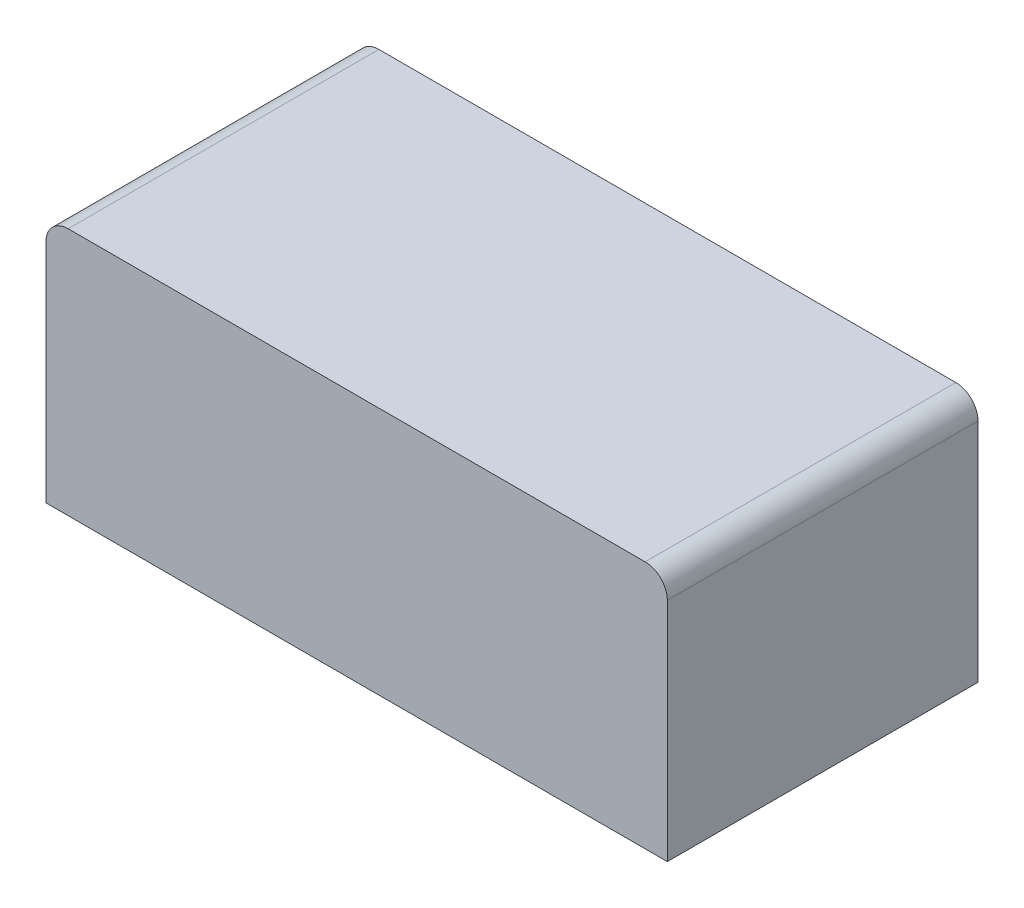
ISO-10303-21;
HEADER;
FILE_DESCRIPTION(('STEP AP214'),'2;1');
FILE_NAME('part.step','',(''),(''),'','','');
FILE_SCHEMA(('AUTOMOTIVE_DESIGN { 1 0 10303 214 1 1 1 1 }'));
ENDSEC;
DATA;
#1=APPLICATION_CONTEXT('core data for automotive mechanical design processes');
#2=APPLICATION_PROTOCOL_DEFINITION('international standard','automotive_design',2000,#1);
#3=PRODUCT_CONTEXT('',#1,'mechanical');
#4=PRODUCT('Part','Part','',(#3));
#5=PRODUCT_RELATED_PRODUCT_CATEGORY('part','',(#4));
#6=PRODUCT_DEFINITION_FORMATION('','',#4);
#7=PRODUCT_DEFINITION_CONTEXT('part definition',#1,'design');
#8=PRODUCT_DEFINITION('design','',#6,#7);
#9=PRODUCT_DEFINITION_SHAPE('','',#8);
#10=(LENGTH_UNIT() NAMED_UNIT(*) SI_UNIT(.MILLI.,.METRE.));
#11=(NAMED_UNIT(*) PLANE_ANGLE_UNIT() SI_UNIT($,.RADIAN.));
#12=(NAMED_UNIT(*) SI_UNIT($,.STERADIAN.) SOLID_ANGLE_UNIT());
#13=UNCERTAINTY_MEASURE_WITH_UNIT(LENGTH_MEASURE(1.E-05),#10,'distance_accuracy_value','');
#14=(GEOMETRIC_REPRESENTATION_CONTEXT(3) GLOBAL_UNCERTAINTY_ASSIGNED_CONTEXT((#13)) GLOBAL_UNIT_ASSIGNED_CONTEXT((#10,
#11,#12)) REPRESENTATION_CONTEXT('',''));
#15=CARTESIAN_POINT('',(0.,0.,0.));
#16=DIRECTION('',(0.,0.,1.));
#17=DIRECTION('',(1.,0.,0.));
#18=AXIS2_PLACEMENT_3D('',#15,#16,#17);
#19=CARTESIAN_POINT('',(1.39999999999999,1.12,0.699999999999992));
#20=DIRECTION('',(0.,0.,-1.));
#21=DIRECTION('',(-1.,0.,0.));
#22=AXIS2_PLACEMENT_3D('',#19,#20,#21);
#23=PLANE('',#22);
#24=DIRECTION('',(0.,-1.,0.));
#25=VECTOR('',#24,1.);
#26=CARTESIAN_POINT('',(1.39999999999999,1.12,0.699999999999992));
#27=LINE('',#26,#25);
#28=CARTESIAN_POINT('',(1.39999999999999,1.02,0.699999999999992));
#29=VERTEX_POINT('',#28);
#30=CARTESIAN_POINT('',(1.39999999999999,0.,0.699999999999992));
#31=VERTEX_POINT('',#30);
#32=EDGE_CURVE('E87',#29,#31,#27,.T.);
#33=ORIENTED_EDGE('',*,*,#32,.F.);
#34=CARTESIAN_POINT('',(1.29999999999999,1.02,0.699999999999993));
#35=DIRECTION('',(0.,0.,-1.));
#36=DIRECTION('',(-1.,0.,0.));
#37=AXIS2_PLACEMENT_3D('',#34,#35,#36);
#38=CIRCLE('',#37,0.1);
#39=CARTESIAN_POINT('',(1.29999999999999,1.12,0.699999999999993));
#40=VERTEX_POINT('',#39);
#41=EDGE_CURVE('E44',#29,#40,#38,.F.);
#42=ORIENTED_EDGE('',*,*,#41,.T.);
#43=DIRECTION('',(1.,0.,0.));
#44=VECTOR('',#43,1.);
#45=CARTESIAN_POINT('',(1.39999999999999,1.12,0.699999999999992));
#46=LINE('',#45,#44);
#47=CARTESIAN_POINT('',(-1.30000000000001,1.12,0.699999999999999));
#48=VERTEX_POINT('',#47);
#49=EDGE_CURVE('E115',#48,#40,#46,.T.);
#50=ORIENTED_EDGE('',*,*,#49,.F.);
#51=CARTESIAN_POINT('',(-1.30000000000001,1.02,0.699999999999999));
#52=DIRECTION('',(0.,0.,-1.));
#53=DIRECTION('',(-1.,0.,0.));
#54=AXIS2_PLACEMENT_3D('',#51,#52,#53);
#55=CIRCLE('',#54,0.1);
#56=CARTESIAN_POINT('',(-1.40000000000001,1.02,0.699999999999999));
#57=VERTEX_POINT('',#56);
#58=EDGE_CURVE('E51',#48,#57,#55,.F.);
#59=ORIENTED_EDGE('',*,*,#58,.T.);
#60=DIRECTION('',(0.,-1.,0.));
#61=VECTOR('',#60,1.);
#62=CARTESIAN_POINT('',(-1.40000000000001,1.12,0.699999999999999));
#63=LINE('',#62,#61);
#64=CARTESIAN_POINT('',(-1.40000000000001,0.,0.699999999999999));
#65=VERTEX_POINT('',#64);
#66=EDGE_CURVE('E105',#57,#65,#63,.T.);
#67=ORIENTED_EDGE('',*,*,#66,.T.);
#68=DIRECTION('',(1.,0.,0.));
#69=VECTOR('',#68,1.);
#70=CARTESIAN_POINT('',(1.39999999999999,0.,0.699999999999992));
#71=LINE('',#70,#69);
#72=EDGE_CURVE('E101',#65,#31,#71,.T.);
#73=ORIENTED_EDGE('',*,*,#72,.T.);
#74=EDGE_LOOP('',(#33,#42,#50,#59,#67,#73));
#75=FACE_BOUND('',#74,.T.);
#76=ADVANCED_FACE('F36',(#75),#23,.F.);
#77=CARTESIAN_POINT('',(1.39999999999999,1.12,0.699999999999992));
#78=DIRECTION('',(-1.,0.,0.));
#79=DIRECTION('',(0.,0.,1.));
#80=AXIS2_PLACEMENT_3D('',#77,#78,#79);
#81=PLANE('',#80);
#82=DIRECTION('',(0.,-1.,0.));
#83=VECTOR('',#82,1.);
#84=CARTESIAN_POINT('',(1.39999999999999,1.12,-0.699999999999992));
#85=LINE('',#84,#83);
#86=CARTESIAN_POINT('',(1.39999999999999,1.02,-0.699999999999992));
#87=VERTEX_POINT('',#86);
#88=CARTESIAN_POINT('',(1.39999999999999,0.,-0.699999999999992));
#89=VERTEX_POINT('',#88);
#90=EDGE_CURVE('E95',#87,#89,#85,.T.);
#91=ORIENTED_EDGE('',*,*,#90,.F.);
#92=DIRECTION('',(0.,0.,-1.));
#93=VECTOR('',#92,1.);
#94=CARTESIAN_POINT('',(1.39999999999999,1.02,0.699999999999992));
#95=LINE('',#94,#93);
#96=EDGE_CURVE('E59',#87,#29,#95,.F.);
#97=ORIENTED_EDGE('',*,*,#96,.T.);
#98=ORIENTED_EDGE('',*,*,#32,.T.);
#99=DIRECTION('',(0.,0.,-1.));
#100=VECTOR('',#99,1.);
#101=CARTESIAN_POINT('',(1.39999999999999,0.,0.699999999999992));
#102=LINE('',#101,#100);
#103=EDGE_CURVE('E90',#31,#89,#102,.T.);
#104=ORIENTED_EDGE('',*,*,#103,.T.);
#105=EDGE_LOOP('',(#91,#97,#98,#104));
#106=FACE_BOUND('',#105,.T.);
#107=ADVANCED_FACE('F89',(#106),#81,.F.);
#108=CARTESIAN_POINT('',(1.39999999999999,1.12,-0.699999999999992));
#109=DIRECTION('',(0.,0.,1.));
#110=DIRECTION('',(1.,0.,0.));
#111=AXIS2_PLACEMENT_3D('',#108,#109,#110);
#112=PLANE('',#111);
#113=DIRECTION('',(-1.,0.,0.));
#114=VECTOR('',#113,1.);
#115=CARTESIAN_POINT('',(1.39999999999999,1.12,-0.699999999999992));
#116=LINE('',#115,#114);
#117=CARTESIAN_POINT('',(1.29999999999999,1.12,-0.699999999999993));
#118=VERTEX_POINT('',#117);
#119=CARTESIAN_POINT('',(-1.30000000000001,1.12,-0.699999999999999));
#120=VERTEX_POINT('',#119);
#121=EDGE_CURVE('E109',#118,#120,#116,.T.);
#122=ORIENTED_EDGE('',*,*,#121,.F.);
#123=CARTESIAN_POINT('',(1.29999999999999,1.02,-0.699999999999993));
#124=DIRECTION('',(0.,0.,1.));
#125=DIRECTION('',(1.,0.,0.));
#126=AXIS2_PLACEMENT_3D('',#123,#124,#125);
#127=CIRCLE('',#126,0.1);
#128=EDGE_CURVE('E127',#118,#87,#127,.F.);
#129=ORIENTED_EDGE('',*,*,#128,.T.);
#130=ORIENTED_EDGE('',*,*,#90,.T.);
#131=DIRECTION('',(-1.,0.,0.));
#132=VECTOR('',#131,1.);
#133=CARTESIAN_POINT('',(1.39999999999999,0.,-0.699999999999992));
#134=LINE('',#133,#132);
#135=CARTESIAN_POINT('',(-1.40000000000001,0.,-0.699999999999999));
#136=VERTEX_POINT('',#135);
#137=EDGE_CURVE('E103',#89,#136,#134,.T.);
#138=ORIENTED_EDGE('',*,*,#137,.T.);
#139=DIRECTION('',(0.,-1.,0.));
#140=VECTOR('',#139,1.);
#141=CARTESIAN_POINT('',(-1.40000000000001,1.12,-0.699999999999999));
#142=LINE('',#141,#140);
#143=CARTESIAN_POINT('',(-1.40000000000001,1.02,-0.699999999999999));
#144=VERTEX_POINT('',#143);
#145=EDGE_CURVE('E117',#144,#136,#142,.T.);
#146=ORIENTED_EDGE('',*,*,#145,.F.);
#147=CARTESIAN_POINT('',(-1.30000000000001,1.02,-0.699999999999999));
#148=DIRECTION('',(0.,0.,1.));
#149=DIRECTION('',(1.,0.,0.));
#150=AXIS2_PLACEMENT_3D('',#147,#148,#149);
#151=CIRCLE('',#150,0.1);
#152=EDGE_CURVE('E125',#144,#120,#151,.F.);
#153=ORIENTED_EDGE('',*,*,#152,.T.);
#154=EDGE_LOOP('',(#122,#129,#130,#138,#146,#153));
#155=FACE_BOUND('',#154,.T.);
#156=ADVANCED_FACE('F140',(#155),#112,.F.);
#157=CARTESIAN_POINT('',(-1.40000000000001,1.12,0.699999999999999));
#158=DIRECTION('',(1.,0.,0.));
#159=DIRECTION('',(0.,0.,-1.));
#160=AXIS2_PLACEMENT_3D('',#157,#158,#159);
#161=PLANE('',#160);
#162=ORIENTED_EDGE('',*,*,#66,.F.);
#163=DIRECTION('',(0.,0.,1.));
#164=VECTOR('',#163,1.);
#165=CARTESIAN_POINT('',(-1.40000000000001,1.02,0.699999999999999));
#166=LINE('',#165,#164);
#167=EDGE_CURVE('E11',#57,#144,#166,.F.);
#168=ORIENTED_EDGE('',*,*,#167,.T.);
#169=ORIENTED_EDGE('',*,*,#145,.T.);
#170=DIRECTION('',(0.,0.,1.));
#171=VECTOR('',#170,1.);
#172=CARTESIAN_POINT('',(-1.40000000000001,0.,0.699999999999999));
#173=LINE('',#172,#171);
#174=EDGE_CURVE('E113',#136,#65,#173,.T.);
#175=ORIENTED_EDGE('',*,*,#174,.T.);
#176=EDGE_LOOP('',(#162,#168,#169,#175));
#177=FACE_BOUND('',#176,.T.);
#178=ADVANCED_FACE('F146',(#177),#161,.F.);
#179=CARTESIAN_POINT('',(-1.40000000000001,1.12,0.699999999999999));
#180=DIRECTION('',(0.,-1.,0.));
#181=DIRECTION('',(0.,0.,-1.));
#182=AXIS2_PLACEMENT_3D('',#179,#180,#181);
#183=PLANE('',#182);
#184=ORIENTED_EDGE('',*,*,#49,.T.);
#185=DIRECTION('',(0.,0.,-1.));
#186=VECTOR('',#185,1.);
#187=CARTESIAN_POINT('',(1.29999999999999,1.12,0.7));
#188=LINE('',#187,#186);
#189=EDGE_CURVE('E122',#40,#118,#188,.T.);
#190=ORIENTED_EDGE('',*,*,#189,.T.);
#191=ORIENTED_EDGE('',*,*,#121,.T.);
#192=DIRECTION('',(0.,0.,1.));
#193=VECTOR('',#192,1.);
#194=CARTESIAN_POINT('',(-1.30000000000001,1.12,0.699999999999999));
#195=LINE('',#194,#193);
#196=EDGE_CURVE('E94',#120,#48,#195,.T.);
#197=ORIENTED_EDGE('',*,*,#196,.T.);
#198=EDGE_LOOP('',(#184,#190,#191,#197));
#199=FACE_BOUND('',#198,.T.);
#200=ADVANCED_FACE('F134',(#199),#183,.F.);
#201=CARTESIAN_POINT('',(-1.40000000000001,0.,0.699999999999999));
#202=DIRECTION('',(0.,-1.,0.));
#203=DIRECTION('',(0.,0.,-1.));
#204=AXIS2_PLACEMENT_3D('',#201,#202,#203);
#205=PLANE('',#204);
#206=ORIENTED_EDGE('',*,*,#72,.F.);
#207=ORIENTED_EDGE('',*,*,#174,.F.);
#208=ORIENTED_EDGE('',*,*,#137,.F.);
#209=ORIENTED_EDGE('',*,*,#103,.F.);
#210=EDGE_LOOP('',(#206,#207,#208,#209));
#211=FACE_BOUND('',#210,.T.);
#212=ADVANCED_FACE('F99',(#211),#205,.T.);
#213=CARTESIAN_POINT('',(1.29999999999999,1.02,0.7));
#214=DIRECTION('',(0.,0.,-1.));
#215=DIRECTION('',(-1.,0.,0.));
#216=AXIS2_PLACEMENT_3D('',#213,#214,#215);
#217=CYLINDRICAL_SURFACE('',#216,0.1);
#218=ORIENTED_EDGE('',*,*,#41,.F.);
#219=ORIENTED_EDGE('',*,*,#96,.F.);
#220=ORIENTED_EDGE('',*,*,#128,.F.);
#221=ORIENTED_EDGE('',*,*,#189,.F.);
#222=EDGE_LOOP('',(#218,#219,#220,#221));
#223=FACE_BOUND('',#222,.T.);
#224=ADVANCED_FACE('F138',(#223),#217,.T.);
#225=CARTESIAN_POINT('',(-1.30000000000001,1.02,0.699999999999999));
#226=DIRECTION('',(0.,0.,1.));
#227=DIRECTION('',(1.,0.,0.));
#228=AXIS2_PLACEMENT_3D('',#225,#226,#227);
#229=CYLINDRICAL_SURFACE('',#228,0.1);
#230=ORIENTED_EDGE('',*,*,#152,.F.);
#231=ORIENTED_EDGE('',*,*,#167,.F.);
#232=ORIENTED_EDGE('',*,*,#58,.F.);
#233=ORIENTED_EDGE('',*,*,#196,.F.);
#234=EDGE_LOOP('',(#230,#231,#232,#233));
#235=FACE_BOUND('',#234,.T.);
#236=ADVANCED_FACE('F38',(#235),#229,.T.);
#237=CLOSED_SHELL('',(#76,#107,#156,#178,#200,#212,#224,#236));
#238=MANIFOLD_SOLID_BREP('B2',#237);
#239=ADVANCED_BREP_SHAPE_REPRESENTATION('',(#18,#238),#14);
#240=SHAPE_DEFINITION_REPRESENTATION(#9,#239);
ENDSEC;
END-ISO-10303-21;
